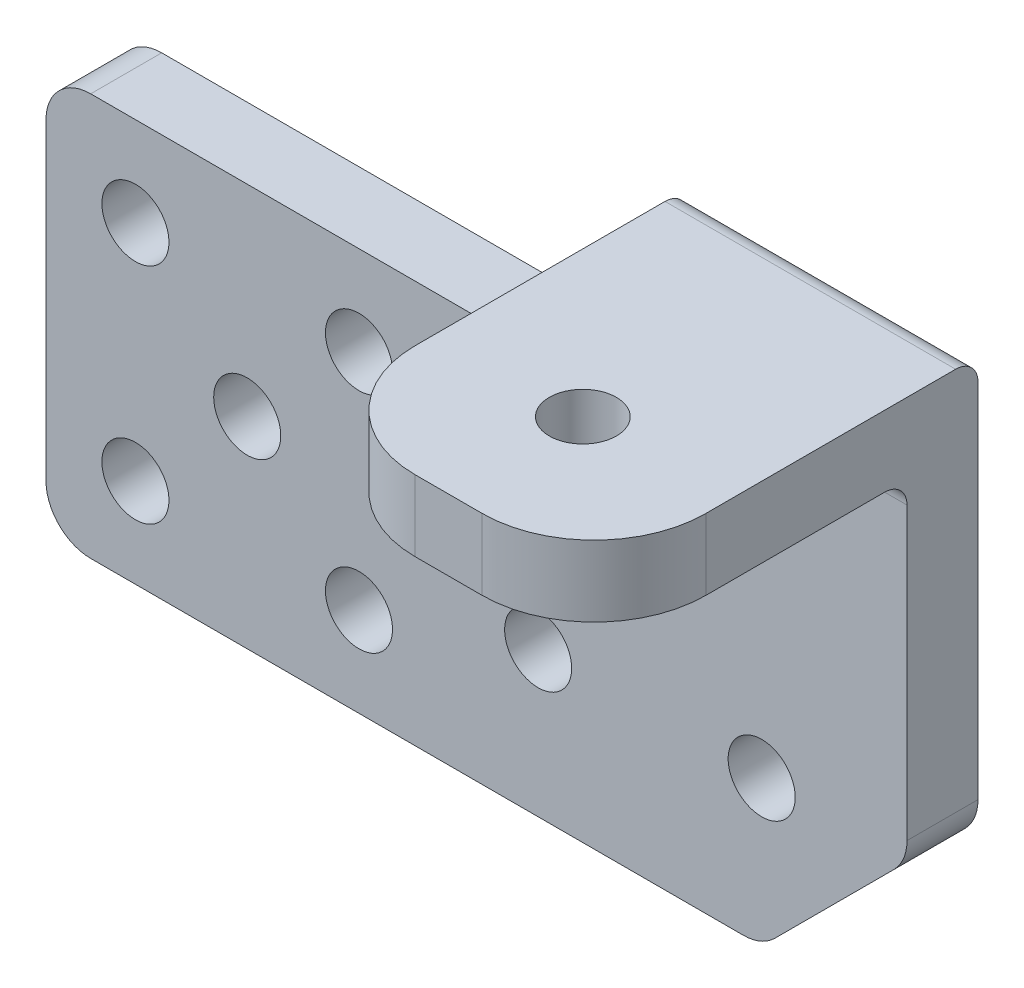
ISO-10303-21;
HEADER;
FILE_DESCRIPTION(('STEP AP214'),'2;1');
FILE_NAME('part.step','',(''),(''),'','','');
FILE_SCHEMA(('AUTOMOTIVE_DESIGN { 1 0 10303 214 1 1 1 1 }'));
ENDSEC;
DATA;
#1=APPLICATION_CONTEXT('core data for automotive mechanical design processes');
#2=APPLICATION_PROTOCOL_DEFINITION('international standard','automotive_design',2000,#1);
#3=PRODUCT_CONTEXT('',#1,'mechanical');
#4=PRODUCT('Part','Part','',(#3));
#5=PRODUCT_RELATED_PRODUCT_CATEGORY('part','',(#4));
#6=PRODUCT_DEFINITION_FORMATION('','',#4);
#7=PRODUCT_DEFINITION_CONTEXT('part definition',#1,'design');
#8=PRODUCT_DEFINITION('design','',#6,#7);
#9=PRODUCT_DEFINITION_SHAPE('','',#8);
#10=(LENGTH_UNIT() NAMED_UNIT(*) SI_UNIT(.MILLI.,.METRE.));
#11=(NAMED_UNIT(*) PLANE_ANGLE_UNIT() SI_UNIT($,.RADIAN.));
#12=(NAMED_UNIT(*) SI_UNIT($,.STERADIAN.) SOLID_ANGLE_UNIT());
#13=UNCERTAINTY_MEASURE_WITH_UNIT(LENGTH_MEASURE(1.E-05),#10,'distance_accuracy_value','');
#14=(GEOMETRIC_REPRESENTATION_CONTEXT(3) GLOBAL_UNCERTAINTY_ASSIGNED_CONTEXT((#13)) GLOBAL_UNIT_ASSIGNED_CONTEXT((#10,
#11,#12)) REPRESENTATION_CONTEXT('',''));
#15=CARTESIAN_POINT('',(0.,0.,0.));
#16=DIRECTION('',(0.,0.,1.));
#17=DIRECTION('',(1.,0.,0.));
#18=AXIS2_PLACEMENT_3D('',#15,#16,#17);
#19=CARTESIAN_POINT('',(6.5,0.,3.175));
#20=DIRECTION('',(1.,0.,0.));
#21=DIRECTION('',(0.,0.,-1.));
#22=AXIS2_PLACEMENT_3D('',#19,#20,#21);
#23=PLANE('',#22);
#24=DIRECTION('',(0.,-1.,0.));
#25=VECTOR('',#24,1.);
#26=CARTESIAN_POINT('',(6.5,0.,3.175));
#27=LINE('',#26,#25);
#28=CARTESIAN_POINT('',(6.5,13.825,3.175));
#29=VERTEX_POINT('',#28);
#30=CARTESIAN_POINT('',(6.5,0.82842712474619,3.175));
#31=VERTEX_POINT('',#30);
#32=EDGE_CURVE('E233',#29,#31,#27,.T.);
#33=ORIENTED_EDGE('',*,*,#32,.T.);
#34=DIRECTION('',(0.,0.,-1.));
#35=VECTOR('',#34,1.);
#36=CARTESIAN_POINT('',(6.5,0.82842712474619,0.));
#37=LINE('',#36,#35);
#38=CARTESIAN_POINT('',(6.5,0.82842712474619,0.));
#39=VERTEX_POINT('',#38);
#40=EDGE_CURVE('E369',#31,#39,#37,.T.);
#41=ORIENTED_EDGE('',*,*,#40,.T.);
#42=DIRECTION('',(0.,-1.,0.));
#43=VECTOR('',#42,1.);
#44=CARTESIAN_POINT('',(6.5,0.,0.));
#45=LINE('',#44,#43);
#46=CARTESIAN_POINT('',(6.5,17.,0.));
#47=VERTEX_POINT('',#46);
#48=EDGE_CURVE('E241',#47,#39,#45,.T.);
#49=ORIENTED_EDGE('',*,*,#48,.F.);
#50=CARTESIAN_POINT('',(6.5,17.,1.));
#51=DIRECTION('',(1.,0.,0.));
#52=DIRECTION('',(0.,0.,-1.));
#53=AXIS2_PLACEMENT_3D('',#50,#51,#52);
#54=CIRCLE('',#53,1.);
#55=CARTESIAN_POINT('',(6.5,18.,1.));
#56=VERTEX_POINT('',#55);
#57=EDGE_CURVE('E273',#47,#56,#54,.T.);
#58=ORIENTED_EDGE('',*,*,#57,.T.);
#59=DIRECTION('',(0.,0.,-1.));
#60=VECTOR('',#59,1.);
#61=CARTESIAN_POINT('',(6.5,18.,3.175));
#62=LINE('',#61,#60);
#63=CARTESIAN_POINT('',(6.5,18.,12.175));
#64=VERTEX_POINT('',#63);
#65=EDGE_CURVE('E250',#64,#56,#62,.T.);
#66=ORIENTED_EDGE('',*,*,#65,.F.);
#67=DIRECTION('',(0.,1.,0.));
#68=VECTOR('',#67,1.);
#69=CARTESIAN_POINT('',(6.5,0.,12.175));
#70=LINE('',#69,#68);
#71=CARTESIAN_POINT('',(6.5,14.825,12.175));
#72=VERTEX_POINT('',#71);
#73=EDGE_CURVE('E266',#64,#72,#70,.F.);
#74=ORIENTED_EDGE('',*,*,#73,.T.);
#75=DIRECTION('',(0.,0.,-1.));
#76=VECTOR('',#75,1.);
#77=CARTESIAN_POINT('',(6.5,14.825,17.175));
#78=LINE('',#77,#76);
#79=CARTESIAN_POINT('',(6.5,14.825,4.175));
#80=VERTEX_POINT('',#79);
#81=EDGE_CURVE('E214',#72,#80,#78,.T.);
#82=ORIENTED_EDGE('',*,*,#81,.T.);
#83=CARTESIAN_POINT('',(6.5,13.825,4.175));
#84=DIRECTION('',(1.,0.,0.));
#85=DIRECTION('',(0.,0.,-1.));
#86=AXIS2_PLACEMENT_3D('',#83,#84,#85);
#87=CIRCLE('',#86,1.);
#88=EDGE_CURVE('E291',#80,#29,#87,.F.);
#89=ORIENTED_EDGE('',*,*,#88,.T.);
#90=EDGE_LOOP('',(#33,#41,#49,#58,#66,#74,#82,#89));
#91=FACE_BOUND('',#90,.T.);
#92=ADVANCED_FACE('F41',(#91),#23,.T.);
#93=CARTESIAN_POINT('',(0.,18.,3.175));
#94=DIRECTION('',(0.,1.,0.));
#95=DIRECTION('',(0.,0.,1.));
#96=AXIS2_PLACEMENT_3D('',#93,#94,#95);
#97=PLANE('',#96);
#98=CARTESIAN_POINT('',(0.,18.,11.175));
#99=DIRECTION('',(0.,1.,0.));
#100=DIRECTION('',(0.,0.,1.));
#101=AXIS2_PLACEMENT_3D('',#98,#99,#100);
#102=CIRCLE('',#101,1.5);
#103=CARTESIAN_POINT('',(0.,18.,12.675));
#104=VERTEX_POINT('',#103);
#105=EDGE_CURVE('E217',#104,#104,#102,.T.);
#106=ORIENTED_EDGE('',*,*,#105,.F.);
#107=EDGE_LOOP('',(#106));
#108=FACE_BOUND('',#107,.T.);
#109=ORIENTED_EDGE('',*,*,#65,.T.);
#110=DIRECTION('',(1.,0.,0.));
#111=VECTOR('',#110,1.);
#112=CARTESIAN_POINT('',(-6.5,18.,1.));
#113=LINE('',#112,#111);
#114=CARTESIAN_POINT('',(-6.5,18.,1.));
#115=VERTEX_POINT('',#114);
#116=EDGE_CURVE('E276',#56,#115,#113,.F.);
#117=ORIENTED_EDGE('',*,*,#116,.T.);
#118=DIRECTION('',(0.,0.,-1.));
#119=VECTOR('',#118,1.);
#120=CARTESIAN_POINT('',(-6.5,18.,3.175));
#121=LINE('',#120,#119);
#122=CARTESIAN_POINT('',(-6.5,18.,12.175));
#123=VERTEX_POINT('',#122);
#124=EDGE_CURVE('E237',#123,#115,#121,.T.);
#125=ORIENTED_EDGE('',*,*,#124,.F.);
#126=CARTESIAN_POINT('',(-1.5,18.,12.175));
#127=DIRECTION('',(0.,1.,0.));
#128=DIRECTION('',(0.,0.,1.));
#129=AXIS2_PLACEMENT_3D('',#126,#127,#128);
#130=CIRCLE('',#129,5.);
#131=CARTESIAN_POINT('',(-1.5,18.,17.175));
#132=VERTEX_POINT('',#131);
#133=EDGE_CURVE('E263',#123,#132,#130,.T.);
#134=ORIENTED_EDGE('',*,*,#133,.T.);
#135=DIRECTION('',(-1.,0.,0.));
#136=VECTOR('',#135,1.);
#137=CARTESIAN_POINT('',(-6.5,18.,17.175));
#138=LINE('',#137,#136);
#139=CARTESIAN_POINT('',(1.5,18.,17.175));
#140=VERTEX_POINT('',#139);
#141=EDGE_CURVE('E202',#140,#132,#138,.T.);
#142=ORIENTED_EDGE('',*,*,#141,.F.);
#143=CARTESIAN_POINT('',(1.5,18.,12.175));
#144=DIRECTION('',(0.,1.,0.));
#145=DIRECTION('',(0.,0.,1.));
#146=AXIS2_PLACEMENT_3D('',#143,#144,#145);
#147=CIRCLE('',#146,5.);
#148=EDGE_CURVE('E260',#140,#64,#147,.T.);
#149=ORIENTED_EDGE('',*,*,#148,.T.);
#150=EDGE_LOOP('',(#109,#117,#125,#134,#142,#149));
#151=FACE_BOUND('',#150,.T.);
#152=ADVANCED_FACE('F527',(#108,#151),#97,.T.);
#153=CARTESIAN_POINT('',(0.,0.,3.175));
#154=DIRECTION('',(0.,0.,-1.));
#155=DIRECTION('',(-1.,0.,0.));
#156=AXIS2_PLACEMENT_3D('',#153,#154,#155);
#157=CYLINDRICAL_SURFACE('',#156,1.5);
#158=CARTESIAN_POINT('',(0.,0.,3.175));
#159=DIRECTION('',(0.,0.,1.));
#160=DIRECTION('',(1.,0.,0.));
#161=AXIS2_PLACEMENT_3D('',#158,#159,#160);
#162=CIRCLE('',#161,1.5);
#163=CARTESIAN_POINT('',(1.5,0.,3.175));
#164=VERTEX_POINT('',#163);
#165=EDGE_CURVE('E229',#164,#164,#162,.T.);
#166=ORIENTED_EDGE('',*,*,#165,.T.);
#167=EDGE_LOOP('',(#166));
#168=FACE_BOUND('',#167,.T.);
#169=CARTESIAN_POINT('',(0.,0.,0.));
#170=DIRECTION('',(0.,0.,1.));
#171=DIRECTION('',(1.,0.,0.));
#172=AXIS2_PLACEMENT_3D('',#169,#170,#171);
#173=CIRCLE('',#172,1.5);
#174=CARTESIAN_POINT('',(1.5,0.,0.));
#175=VERTEX_POINT('',#174);
#176=EDGE_CURVE('E228',#175,#175,#173,.T.);
#177=ORIENTED_EDGE('',*,*,#176,.F.);
#178=EDGE_LOOP('',(#177));
#179=FACE_BOUND('',#178,.T.);
#180=ADVANCED_FACE('F532',(#168,#179),#157,.F.);
#181=CARTESIAN_POINT('',(-6.5,0.,3.175));
#182=DIRECTION('',(-1.,0.,0.));
#183=DIRECTION('',(0.,0.,1.));
#184=AXIS2_PLACEMENT_3D('',#181,#182,#183);
#185=PLANE('',#184);
#186=DIRECTION('',(0.,1.,0.));
#187=VECTOR('',#186,1.);
#188=CARTESIAN_POINT('',(-6.5,0.,0.));
#189=LINE('',#188,#187);
#190=CARTESIAN_POINT('',(-6.5,16.3284271247462,0.));
#191=VERTEX_POINT('',#190);
#192=CARTESIAN_POINT('',(-6.5,17.,0.));
#193=VERTEX_POINT('',#192);
#194=EDGE_CURVE('E234',#191,#193,#189,.T.);
#195=ORIENTED_EDGE('',*,*,#194,.F.);
#196=DIRECTION('',(0.,0.,-1.));
#197=VECTOR('',#196,1.);
#198=CARTESIAN_POINT('',(-6.5,16.3284271247462,3.175));
#199=LINE('',#198,#197);
#200=CARTESIAN_POINT('',(-6.5,16.3284271247462,3.175));
#201=VERTEX_POINT('',#200);
#202=EDGE_CURVE('E345',#191,#201,#199,.F.);
#203=ORIENTED_EDGE('',*,*,#202,.T.);
#204=DIRECTION('',(0.,-1.,0.));
#205=VECTOR('',#204,1.);
#206=CARTESIAN_POINT('',(-6.5,0.,3.175));
#207=LINE('',#206,#205);
#208=CARTESIAN_POINT('',(-6.5,13.825,3.175));
#209=VERTEX_POINT('',#208);
#210=EDGE_CURVE('E297',#201,#209,#207,.T.);
#211=ORIENTED_EDGE('',*,*,#210,.T.);
#212=CARTESIAN_POINT('',(-6.5,13.825,4.175));
#213=DIRECTION('',(-1.,0.,0.));
#214=DIRECTION('',(0.,0.,1.));
#215=AXIS2_PLACEMENT_3D('',#212,#213,#214);
#216=CIRCLE('',#215,1.);
#217=CARTESIAN_POINT('',(-6.5,14.825,4.175));
#218=VERTEX_POINT('',#217);
#219=EDGE_CURVE('E294',#209,#218,#216,.F.);
#220=ORIENTED_EDGE('',*,*,#219,.T.);
#221=DIRECTION('',(0.,0.,-1.));
#222=VECTOR('',#221,1.);
#223=CARTESIAN_POINT('',(-6.5,14.825,17.175));
#224=LINE('',#223,#222);
#225=CARTESIAN_POINT('',(-6.5,14.825,12.175));
#226=VERTEX_POINT('',#225);
#227=EDGE_CURVE('E225',#226,#218,#224,.T.);
#228=ORIENTED_EDGE('',*,*,#227,.F.);
#229=DIRECTION('',(0.,-1.,0.));
#230=VECTOR('',#229,1.);
#231=CARTESIAN_POINT('',(-6.5,0.,12.175));
#232=LINE('',#231,#230);
#233=EDGE_CURVE('E186',#226,#123,#232,.F.);
#234=ORIENTED_EDGE('',*,*,#233,.T.);
#235=ORIENTED_EDGE('',*,*,#124,.T.);
#236=CARTESIAN_POINT('',(-6.5,17.,1.));
#237=DIRECTION('',(-1.,0.,0.));
#238=DIRECTION('',(0.,0.,1.));
#239=AXIS2_PLACEMENT_3D('',#236,#237,#238);
#240=CIRCLE('',#239,1.);
#241=EDGE_CURVE('E279',#115,#193,#240,.T.);
#242=ORIENTED_EDGE('',*,*,#241,.T.);
#243=EDGE_LOOP('',(#195,#203,#211,#220,#228,#234,#235,#242));
#244=FACE_BOUND('',#243,.T.);
#245=ADVANCED_FACE('F399',(#244),#185,.T.);
#246=CARTESIAN_POINT('',(0.,0.,3.175));
#247=DIRECTION('',(0.,0.,1.));
#248=DIRECTION('',(1.,0.,0.));
#249=AXIS2_PLACEMENT_3D('',#246,#247,#248);
#250=PLANE('',#249);
#251=DIRECTION('',(-1.,0.,0.));
#252=VECTOR('',#251,1.);
#253=CARTESIAN_POINT('',(0.,-6.5,3.175));
#254=LINE('',#253,#252);
#255=CARTESIAN_POINT('',(-0.82842712474619,-6.5,3.175));
#256=VERTEX_POINT('',#255);
#257=CARTESIAN_POINT('',(-30.0129229130922,-6.5,3.175));
#258=VERTEX_POINT('',#257);
#259=EDGE_CURVE('E474',#256,#258,#254,.T.);
#260=ORIENTED_EDGE('',*,*,#259,.F.);
#261=CARTESIAN_POINT('',(-0.82842712474619,-4.5,3.175));
#262=DIRECTION('',(0.,0.,1.));
#263=DIRECTION('',(1.,0.,0.));
#264=AXIS2_PLACEMENT_3D('',#261,#262,#263);
#265=CIRCLE('',#264,2.);
#266=CARTESIAN_POINT('',(0.585786437626904,-5.9142135623731,3.175));
#267=VERTEX_POINT('',#266);
#268=EDGE_CURVE('E366',#256,#267,#265,.T.);
#269=ORIENTED_EDGE('',*,*,#268,.T.);
#270=DIRECTION('',(-0.707106781186548,-0.707106781186548,0.));
#271=VECTOR('',#270,1.);
#272=CARTESIAN_POINT('',(3.25,-3.25,3.175));
#273=LINE('',#272,#271);
#274=CARTESIAN_POINT('',(5.9142135623731,-0.585786437626904,3.175));
#275=VERTEX_POINT('',#274);
#276=EDGE_CURVE('E419',#275,#267,#273,.T.);
#277=ORIENTED_EDGE('',*,*,#276,.F.);
#278=CARTESIAN_POINT('',(4.5,0.82842712474619,3.175));
#279=DIRECTION('',(0.,0.,1.));
#280=DIRECTION('',(1.,0.,0.));
#281=AXIS2_PLACEMENT_3D('',#278,#279,#280);
#282=CIRCLE('',#281,2.);
#283=EDGE_CURVE('E57',#275,#31,#282,.T.);
#284=ORIENTED_EDGE('',*,*,#283,.T.);
#285=ORIENTED_EDGE('',*,*,#32,.F.);
#286=DIRECTION('',(1.,0.,0.));
#287=VECTOR('',#286,1.);
#288=CARTESIAN_POINT('',(0.,13.825,3.175));
#289=LINE('',#288,#287);
#290=EDGE_CURVE('E287',#29,#209,#289,.F.);
#291=ORIENTED_EDGE('',*,*,#290,.T.);
#292=ORIENTED_EDGE('',*,*,#210,.F.);
#293=CARTESIAN_POINT('',(-8.5,16.3284271247462,3.175));
#294=DIRECTION('',(0.,0.,1.));
#295=DIRECTION('',(1.,0.,0.));
#296=AXIS2_PLACEMENT_3D('',#293,#294,#295);
#297=CIRCLE('',#296,2.);
#298=CARTESIAN_POINT('',(-7.08578643762691,14.9142135623731,3.175));
#299=VERTEX_POINT('',#298);
#300=EDGE_CURVE('E50',#201,#299,#297,.F.);
#301=ORIENTED_EDGE('',*,*,#300,.T.);
#302=DIRECTION('',(0.707106781186551,0.707106781186544,0.));
#303=VECTOR('',#302,1.);
#304=CARTESIAN_POINT('',(-10.5,11.5,3.175));
#305=LINE('',#304,#303);
#306=CARTESIAN_POINT('',(-9.91421356237311,12.0857864376269,3.175));
#307=VERTEX_POINT('',#306);
#308=EDGE_CURVE('E304',#299,#307,#305,.F.);
#309=ORIENTED_EDGE('',*,*,#308,.T.);
#310=CARTESIAN_POINT('',(-11.3284271247462,13.5,3.175));
#311=DIRECTION('',(0.,0.,1.));
#312=DIRECTION('',(1.,0.,0.));
#313=AXIS2_PLACEMENT_3D('',#310,#311,#312);
#314=CIRCLE('',#313,2.);
#315=CARTESIAN_POINT('',(-11.3284271247462,11.5,3.175));
#316=VERTEX_POINT('',#315);
#317=EDGE_CURVE('E376',#307,#316,#314,.F.);
#318=ORIENTED_EDGE('',*,*,#317,.T.);
#319=DIRECTION('',(1.,0.,0.));
#320=VECTOR('',#319,1.);
#321=CARTESIAN_POINT('',(0.,11.5,3.175));
#322=LINE('',#321,#320);
#323=CARTESIAN_POINT('',(-30.0129229130922,11.5,3.175));
#324=VERTEX_POINT('',#323);
#325=EDGE_CURVE('E469',#324,#316,#322,.T.);
#326=ORIENTED_EDGE('',*,*,#325,.F.);
#327=CARTESIAN_POINT('',(-30.0129229130922,9.50000000000003,3.175));
#328=DIRECTION('',(0.,0.,1.));
#329=DIRECTION('',(1.,0.,0.));
#330=AXIS2_PLACEMENT_3D('',#327,#328,#329);
#331=CIRCLE('',#330,2.);
#332=CARTESIAN_POINT('',(-32.0129229130922,9.50000000000003,3.175));
#333=VERTEX_POINT('',#332);
#334=EDGE_CURVE('E325',#324,#333,#331,.T.);
#335=ORIENTED_EDGE('',*,*,#334,.T.);
#336=DIRECTION('',(0.,1.,0.));
#337=VECTOR('',#336,1.);
#338=CARTESIAN_POINT('',(-32.0129229130922,0.,3.175));
#339=LINE('',#338,#337);
#340=CARTESIAN_POINT('',(-32.0129229130922,-4.5,3.175));
#341=VERTEX_POINT('',#340);
#342=EDGE_CURVE('E465',#341,#333,#339,.T.);
#343=ORIENTED_EDGE('',*,*,#342,.F.);
#344=CARTESIAN_POINT('',(-30.0129229130922,-4.5,3.175));
#345=DIRECTION('',(0.,0.,1.));
#346=DIRECTION('',(1.,0.,0.));
#347=AXIS2_PLACEMENT_3D('',#344,#345,#346);
#348=CIRCLE('',#347,2.);
#349=EDGE_CURVE('E328',#341,#258,#348,.T.);
#350=ORIENTED_EDGE('',*,*,#349,.T.);
#351=EDGE_LOOP('',(#260,#269,#277,#284,#285,#291,#292,#301,#309,#318,#326,#335,#343,#350));
#352=FACE_BOUND('',#351,.T.);
#353=CARTESIAN_POINT('',(-28.0129229130922,7.50000000000006,3.175));
#354=DIRECTION('',(0.,0.,-1.));
#355=DIRECTION('',(-1.,0.,0.));
#356=AXIS2_PLACEMENT_3D('',#353,#354,#355);
#357=CIRCLE('',#356,1.50000000000011);
#358=CARTESIAN_POINT('',(-29.5129229130923,7.50000000000006,3.175));
#359=VERTEX_POINT('',#358);
#360=EDGE_CURVE('E450',#359,#359,#357,.T.);
#361=ORIENTED_EDGE('',*,*,#360,.T.);
#362=EDGE_LOOP('',(#361));
#363=FACE_BOUND('',#362,.T.);
#364=CARTESIAN_POINT('',(-28.0129229130922,-2.49999999999994,3.175));
#365=DIRECTION('',(0.,0.,-1.));
#366=DIRECTION('',(-1.,0.,0.));
#367=AXIS2_PLACEMENT_3D('',#364,#365,#366);
#368=CIRCLE('',#367,1.50000000000011);
#369=CARTESIAN_POINT('',(-29.5129229130923,-2.49999999999994,3.175));
#370=VERTEX_POINT('',#369);
#371=EDGE_CURVE('E442',#370,#370,#368,.T.);
#372=ORIENTED_EDGE('',*,*,#371,.T.);
#373=EDGE_LOOP('',(#372));
#374=FACE_BOUND('',#373,.T.);
#375=CARTESIAN_POINT('',(-18.0129229130922,-2.49999999999994,3.175));
#376=DIRECTION('',(0.,0.,-1.));
#377=DIRECTION('',(-1.,0.,0.));
#378=AXIS2_PLACEMENT_3D('',#375,#376,#377);
#379=CIRCLE('',#378,1.5000000000001);
#380=CARTESIAN_POINT('',(-19.5129229130923,-2.49999999999994,3.175));
#381=VERTEX_POINT('',#380);
#382=EDGE_CURVE('E434',#381,#381,#379,.T.);
#383=ORIENTED_EDGE('',*,*,#382,.T.);
#384=EDGE_LOOP('',(#383));
#385=FACE_BOUND('',#384,.T.);
#386=CARTESIAN_POINT('',(-23.0129229130923,2.50000000000004,3.175));
#387=DIRECTION('',(0.,0.,-1.));
#388=DIRECTION('',(-1.,0.,0.));
#389=AXIS2_PLACEMENT_3D('',#386,#387,#388);
#390=CIRCLE('',#389,1.5);
#391=CARTESIAN_POINT('',(-24.5129229130923,2.50000000000004,3.175));
#392=VERTEX_POINT('',#391);
#393=EDGE_CURVE('E425',#392,#392,#390,.T.);
#394=ORIENTED_EDGE('',*,*,#393,.T.);
#395=EDGE_LOOP('',(#394));
#396=FACE_BOUND('',#395,.T.);
#397=CARTESIAN_POINT('',(-18.0129229130922,7.50000000000006,3.175));
#398=DIRECTION('',(0.,0.,-1.));
#399=DIRECTION('',(-1.,0.,0.));
#400=AXIS2_PLACEMENT_3D('',#397,#398,#399);
#401=CIRCLE('',#400,1.50000000000011);
#402=CARTESIAN_POINT('',(-19.5129229130923,7.50000000000006,3.175));
#403=VERTEX_POINT('',#402);
#404=EDGE_CURVE('E457',#403,#403,#401,.T.);
#405=ORIENTED_EDGE('',*,*,#404,.T.);
#406=EDGE_LOOP('',(#405));
#407=FACE_BOUND('',#406,.T.);
#408=ORIENTED_EDGE('',*,*,#165,.F.);
#409=EDGE_LOOP('',(#408));
#410=FACE_BOUND('',#409,.T.);
#411=CARTESIAN_POINT('',(-10.,0.,3.175));
#412=DIRECTION('',(0.,0.,1.));
#413=DIRECTION('',(1.,0.,0.));
#414=AXIS2_PLACEMENT_3D('',#411,#412,#413);
#415=CIRCLE('',#414,1.5);
#416=CARTESIAN_POINT('',(-8.5,0.,3.175));
#417=VERTEX_POINT('',#416);
#418=EDGE_CURVE('E488',#417,#417,#415,.F.);
#419=ORIENTED_EDGE('',*,*,#418,.T.);
#420=EDGE_LOOP('',(#419));
#421=FACE_BOUND('',#420,.T.);
#422=ADVANCED_FACE('F381',(#352,#363,#374,#385,#396,#407,#410,#421),#250,.T.);
#423=CARTESIAN_POINT('',(0.,0.,0.));
#424=DIRECTION('',(0.,0.,1.));
#425=DIRECTION('',(1.,0.,0.));
#426=AXIS2_PLACEMENT_3D('',#423,#424,#425);
#427=PLANE('',#426);
#428=CARTESIAN_POINT('',(-28.0129229130922,7.50000000000006,0.));
#429=DIRECTION('',(0.,0.,-1.));
#430=DIRECTION('',(-1.,0.,0.));
#431=AXIS2_PLACEMENT_3D('',#428,#429,#430);
#432=CIRCLE('',#431,1.50000000000011);
#433=CARTESIAN_POINT('',(-29.5129229130923,7.50000000000006,0.));
#434=VERTEX_POINT('',#433);
#435=EDGE_CURVE('E422',#434,#434,#432,.T.);
#436=ORIENTED_EDGE('',*,*,#435,.F.);
#437=EDGE_LOOP('',(#436));
#438=FACE_BOUND('',#437,.T.);
#439=CARTESIAN_POINT('',(-28.0129229130922,-2.49999999999994,0.));
#440=DIRECTION('',(0.,0.,-1.));
#441=DIRECTION('',(-1.,0.,0.));
#442=AXIS2_PLACEMENT_3D('',#439,#440,#441);
#443=CIRCLE('',#442,1.50000000000011);
#444=CARTESIAN_POINT('',(-29.5129229130923,-2.49999999999994,0.));
#445=VERTEX_POINT('',#444);
#446=EDGE_CURVE('E446',#445,#445,#443,.T.);
#447=ORIENTED_EDGE('',*,*,#446,.F.);
#448=EDGE_LOOP('',(#447));
#449=FACE_BOUND('',#448,.T.);
#450=CARTESIAN_POINT('',(-18.0129229130922,-2.49999999999994,0.));
#451=DIRECTION('',(0.,0.,-1.));
#452=DIRECTION('',(-1.,0.,0.));
#453=AXIS2_PLACEMENT_3D('',#450,#451,#452);
#454=CIRCLE('',#453,1.5000000000001);
#455=CARTESIAN_POINT('',(-19.5129229130923,-2.49999999999994,0.));
#456=VERTEX_POINT('',#455);
#457=EDGE_CURVE('E438',#456,#456,#454,.T.);
#458=ORIENTED_EDGE('',*,*,#457,.F.);
#459=EDGE_LOOP('',(#458));
#460=FACE_BOUND('',#459,.T.);
#461=CARTESIAN_POINT('',(-23.0129229130923,2.50000000000004,0.));
#462=DIRECTION('',(0.,0.,-1.));
#463=DIRECTION('',(-1.,0.,0.));
#464=AXIS2_PLACEMENT_3D('',#461,#462,#463);
#465=CIRCLE('',#464,1.5);
#466=CARTESIAN_POINT('',(-24.5129229130923,2.50000000000004,0.));
#467=VERTEX_POINT('',#466);
#468=EDGE_CURVE('E430',#467,#467,#465,.T.);
#469=ORIENTED_EDGE('',*,*,#468,.F.);
#470=EDGE_LOOP('',(#469));
#471=FACE_BOUND('',#470,.T.);
#472=CARTESIAN_POINT('',(-18.0129229130922,7.50000000000006,0.));
#473=DIRECTION('',(0.,0.,-1.));
#474=DIRECTION('',(-1.,0.,0.));
#475=AXIS2_PLACEMENT_3D('',#472,#473,#474);
#476=CIRCLE('',#475,1.50000000000011);
#477=CARTESIAN_POINT('',(-19.5129229130923,7.50000000000006,0.));
#478=VERTEX_POINT('',#477);
#479=EDGE_CURVE('E429',#478,#478,#476,.T.);
#480=ORIENTED_EDGE('',*,*,#479,.F.);
#481=EDGE_LOOP('',(#480));
#482=FACE_BOUND('',#481,.T.);
#483=DIRECTION('',(0.707106781186548,0.707106781186548,0.));
#484=VECTOR('',#483,1.);
#485=CARTESIAN_POINT('',(6.5,0.,0.));
#486=LINE('',#485,#484);
#487=CARTESIAN_POINT('',(0.585786437626904,-5.9142135623731,0.));
#488=VERTEX_POINT('',#487);
#489=CARTESIAN_POINT('',(5.9142135623731,-0.585786437626905,0.));
#490=VERTEX_POINT('',#489);
#491=EDGE_CURVE('E413',#488,#490,#486,.T.);
#492=ORIENTED_EDGE('',*,*,#491,.F.);
#493=CARTESIAN_POINT('',(-0.82842712474619,-4.5,0.));
#494=DIRECTION('',(0.,0.,1.));
#495=DIRECTION('',(1.,0.,0.));
#496=AXIS2_PLACEMENT_3D('',#493,#494,#495);
#497=CIRCLE('',#496,2.);
#498=CARTESIAN_POINT('',(-0.82842712474619,-6.5,0.));
#499=VERTEX_POINT('',#498);
#500=EDGE_CURVE('E359',#488,#499,#497,.F.);
#501=ORIENTED_EDGE('',*,*,#500,.T.);
#502=DIRECTION('',(-1.,0.,0.));
#503=VECTOR('',#502,1.);
#504=CARTESIAN_POINT('',(0.,-6.5,0.));
#505=LINE('',#504,#503);
#506=CARTESIAN_POINT('',(-30.0129229130922,-6.5,0.));
#507=VERTEX_POINT('',#506);
#508=EDGE_CURVE('E485',#499,#507,#505,.T.);
#509=ORIENTED_EDGE('',*,*,#508,.T.);
#510=CARTESIAN_POINT('',(-30.0129229130922,-4.5,0.));
#511=DIRECTION('',(0.,0.,1.));
#512=DIRECTION('',(1.,0.,0.));
#513=AXIS2_PLACEMENT_3D('',#510,#511,#512);
#514=CIRCLE('',#513,2.);
#515=CARTESIAN_POINT('',(-32.0129229130922,-4.5,0.));
#516=VERTEX_POINT('',#515);
#517=EDGE_CURVE('E315',#507,#516,#514,.F.);
#518=ORIENTED_EDGE('',*,*,#517,.T.);
#519=DIRECTION('',(0.,1.,0.));
#520=VECTOR('',#519,1.);
#521=CARTESIAN_POINT('',(-32.0129229130922,0.,0.));
#522=LINE('',#521,#520);
#523=CARTESIAN_POINT('',(-32.0129229130922,9.50000000000003,0.));
#524=VERTEX_POINT('',#523);
#525=EDGE_CURVE('E461',#516,#524,#522,.T.);
#526=ORIENTED_EDGE('',*,*,#525,.T.);
#527=CARTESIAN_POINT('',(-30.0129229130922,9.50000000000003,0.));
#528=DIRECTION('',(0.,0.,1.));
#529=DIRECTION('',(1.,0.,0.));
#530=AXIS2_PLACEMENT_3D('',#527,#528,#529);
#531=CIRCLE('',#530,2.);
#532=CARTESIAN_POINT('',(-30.0129229130922,11.5,0.));
#533=VERTEX_POINT('',#532);
#534=EDGE_CURVE('E312',#524,#533,#531,.F.);
#535=ORIENTED_EDGE('',*,*,#534,.T.);
#536=DIRECTION('',(1.,0.,0.));
#537=VECTOR('',#536,1.);
#538=CARTESIAN_POINT('',(0.,11.5,0.));
#539=LINE('',#538,#537);
#540=CARTESIAN_POINT('',(-11.3284271247462,11.5,0.));
#541=VERTEX_POINT('',#540);
#542=EDGE_CURVE('E470',#533,#541,#539,.T.);
#543=ORIENTED_EDGE('',*,*,#542,.T.);
#544=CARTESIAN_POINT('',(-11.3284271247462,13.5,0.));
#545=DIRECTION('',(0.,0.,1.));
#546=DIRECTION('',(1.,0.,0.));
#547=AXIS2_PLACEMENT_3D('',#544,#545,#546);
#548=CIRCLE('',#547,2.);
#549=CARTESIAN_POINT('',(-9.91421356237312,12.0857864376269,0.));
#550=VERTEX_POINT('',#549);
#551=EDGE_CURVE('E373',#541,#550,#548,.T.);
#552=ORIENTED_EDGE('',*,*,#551,.T.);
#553=DIRECTION('',(-0.707106781186551,-0.707106781186544,0.));
#554=VECTOR('',#553,1.);
#555=CARTESIAN_POINT('',(-11.,11.0000000000001,0.));
#556=LINE('',#555,#554);
#557=CARTESIAN_POINT('',(-7.08578643762691,14.9142135623731,0.));
#558=VERTEX_POINT('',#557);
#559=EDGE_CURVE('E300',#550,#558,#556,.F.);
#560=ORIENTED_EDGE('',*,*,#559,.T.);
#561=CARTESIAN_POINT('',(-8.5,16.3284271247462,0.));
#562=DIRECTION('',(0.,0.,1.));
#563=DIRECTION('',(1.,0.,0.));
#564=AXIS2_PLACEMENT_3D('',#561,#562,#563);
#565=CIRCLE('',#564,2.);
#566=EDGE_CURVE('E11',#558,#191,#565,.T.);
#567=ORIENTED_EDGE('',*,*,#566,.T.);
#568=ORIENTED_EDGE('',*,*,#194,.T.);
#569=DIRECTION('',(1.,0.,0.));
#570=VECTOR('',#569,1.);
#571=CARTESIAN_POINT('',(6.5,17.,0.));
#572=LINE('',#571,#570);
#573=EDGE_CURVE('E269',#193,#47,#572,.T.);
#574=ORIENTED_EDGE('',*,*,#573,.T.);
#575=ORIENTED_EDGE('',*,*,#48,.T.);
#576=CARTESIAN_POINT('',(4.5,0.82842712474619,0.));
#577=DIRECTION('',(0.,0.,1.));
#578=DIRECTION('',(1.,0.,0.));
#579=AXIS2_PLACEMENT_3D('',#576,#577,#578);
#580=CIRCLE('',#579,2.);
#581=EDGE_CURVE('E356',#39,#490,#580,.F.);
#582=ORIENTED_EDGE('',*,*,#581,.T.);
#583=EDGE_LOOP('',(#492,#501,#509,#518,#526,#535,#543,#552,#560,#567,#568,#574,#575,#582));
#584=FACE_BOUND('',#583,.T.);
#585=CARTESIAN_POINT('',(-10.,0.,0.));
#586=DIRECTION('',(0.,0.,-1.));
#587=DIRECTION('',(-1.,0.,0.));
#588=AXIS2_PLACEMENT_3D('',#585,#586,#587);
#589=CIRCLE('',#588,1.5);
#590=CARTESIAN_POINT('',(-11.5,0.,0.));
#591=VERTEX_POINT('',#590);
#592=EDGE_CURVE('E481',#591,#591,#589,.T.);
#593=ORIENTED_EDGE('',*,*,#592,.F.);
#594=EDGE_LOOP('',(#593));
#595=FACE_BOUND('',#594,.T.);
#596=ORIENTED_EDGE('',*,*,#176,.T.);
#597=EDGE_LOOP('',(#596));
#598=FACE_BOUND('',#597,.T.);
#599=ADVANCED_FACE('F396',(#438,#449,#460,#471,#482,#584,#595,#598),#427,.F.);
#600=CARTESIAN_POINT('',(-6.5,14.825,17.175));
#601=DIRECTION('',(0.,1.,0.));
#602=DIRECTION('',(0.,0.,1.));
#603=AXIS2_PLACEMENT_3D('',#600,#601,#602);
#604=PLANE('',#603);
#605=CARTESIAN_POINT('',(0.,14.825,11.175));
#606=DIRECTION('',(0.,1.,0.));
#607=DIRECTION('',(0.,0.,1.));
#608=AXIS2_PLACEMENT_3D('',#605,#606,#607);
#609=CIRCLE('',#608,1.5);
#610=CARTESIAN_POINT('',(0.,14.825,12.675));
#611=VERTEX_POINT('',#610);
#612=EDGE_CURVE('E210',#611,#611,#609,.T.);
#613=ORIENTED_EDGE('',*,*,#612,.T.);
#614=EDGE_LOOP('',(#613));
#615=FACE_BOUND('',#614,.T.);
#616=ORIENTED_EDGE('',*,*,#227,.T.);
#617=DIRECTION('',(1.,0.,0.));
#618=VECTOR('',#617,1.);
#619=CARTESIAN_POINT('',(-6.5,14.825,4.175));
#620=LINE('',#619,#618);
#621=EDGE_CURVE('E283',#218,#80,#620,.T.);
#622=ORIENTED_EDGE('',*,*,#621,.T.);
#623=ORIENTED_EDGE('',*,*,#81,.F.);
#624=CARTESIAN_POINT('',(1.5,14.825,12.175));
#625=DIRECTION('',(0.,1.,0.));
#626=DIRECTION('',(0.,0.,1.));
#627=AXIS2_PLACEMENT_3D('',#624,#625,#626);
#628=CIRCLE('',#627,5.);
#629=CARTESIAN_POINT('',(1.5,14.825,17.175));
#630=VERTEX_POINT('',#629);
#631=EDGE_CURVE('E192',#72,#630,#628,.F.);
#632=ORIENTED_EDGE('',*,*,#631,.T.);
#633=DIRECTION('',(1.,0.,0.));
#634=VECTOR('',#633,1.);
#635=CARTESIAN_POINT('',(-6.5,14.825,17.175));
#636=LINE('',#635,#634);
#637=CARTESIAN_POINT('',(-1.5,14.825,17.175));
#638=VERTEX_POINT('',#637);
#639=EDGE_CURVE('E199',#638,#630,#636,.T.);
#640=ORIENTED_EDGE('',*,*,#639,.F.);
#641=CARTESIAN_POINT('',(-1.5,14.825,12.175));
#642=DIRECTION('',(0.,1.,0.));
#643=DIRECTION('',(0.,0.,1.));
#644=AXIS2_PLACEMENT_3D('',#641,#642,#643);
#645=CIRCLE('',#644,5.);
#646=EDGE_CURVE('E181',#638,#226,#645,.F.);
#647=ORIENTED_EDGE('',*,*,#646,.T.);
#648=EDGE_LOOP('',(#616,#622,#623,#632,#640,#647));
#649=FACE_BOUND('',#648,.T.);
#650=ADVANCED_FACE('F206',(#615,#649),#604,.F.);
#651=CARTESIAN_POINT('',(0.,0.,17.175));
#652=DIRECTION('',(0.,0.,1.));
#653=DIRECTION('',(1.,0.,0.));
#654=AXIS2_PLACEMENT_3D('',#651,#652,#653);
#655=PLANE('',#654);
#656=ORIENTED_EDGE('',*,*,#141,.T.);
#657=DIRECTION('',(0.,-1.,0.));
#658=VECTOR('',#657,1.);
#659=CARTESIAN_POINT('',(-1.5,0.,17.175));
#660=LINE('',#659,#658);
#661=EDGE_CURVE('E185',#132,#638,#660,.T.);
#662=ORIENTED_EDGE('',*,*,#661,.T.);
#663=ORIENTED_EDGE('',*,*,#639,.T.);
#664=DIRECTION('',(0.,1.,0.));
#665=VECTOR('',#664,1.);
#666=CARTESIAN_POINT('',(1.5,0.,17.175));
#667=LINE('',#666,#665);
#668=EDGE_CURVE('E204',#630,#140,#667,.T.);
#669=ORIENTED_EDGE('',*,*,#668,.T.);
#670=EDGE_LOOP('',(#656,#662,#663,#669));
#671=FACE_BOUND('',#670,.T.);
#672=ADVANCED_FACE('F197',(#671),#655,.T.);
#673=CARTESIAN_POINT('',(0.,0.,11.175));
#674=DIRECTION('',(0.,1.,0.));
#675=DIRECTION('',(0.,0.,1.));
#676=AXIS2_PLACEMENT_3D('',#673,#674,#675);
#677=CYLINDRICAL_SURFACE('',#676,1.5);
#678=ORIENTED_EDGE('',*,*,#105,.T.);
#679=EDGE_LOOP('',(#678));
#680=FACE_BOUND('',#679,.T.);
#681=ORIENTED_EDGE('',*,*,#612,.F.);
#682=EDGE_LOOP('',(#681));
#683=FACE_BOUND('',#682,.T.);
#684=ADVANCED_FACE('F543',(#680,#683),#677,.F.);
#685=CARTESIAN_POINT('',(-1.5,0.,12.175));
#686=DIRECTION('',(0.,-1.,0.));
#687=DIRECTION('',(0.,0.,-1.));
#688=AXIS2_PLACEMENT_3D('',#685,#686,#687);
#689=CYLINDRICAL_SURFACE('',#688,5.);
#690=ORIENTED_EDGE('',*,*,#133,.F.);
#691=ORIENTED_EDGE('',*,*,#233,.F.);
#692=ORIENTED_EDGE('',*,*,#646,.F.);
#693=ORIENTED_EDGE('',*,*,#661,.F.);
#694=EDGE_LOOP('',(#690,#691,#692,#693));
#695=FACE_BOUND('',#694,.T.);
#696=ADVANCED_FACE('F184',(#695),#689,.T.);
#697=CARTESIAN_POINT('',(1.5,0.,12.175));
#698=DIRECTION('',(0.,1.,0.));
#699=DIRECTION('',(0.,0.,1.));
#700=AXIS2_PLACEMENT_3D('',#697,#698,#699);
#701=CYLINDRICAL_SURFACE('',#700,5.);
#702=ORIENTED_EDGE('',*,*,#631,.F.);
#703=ORIENTED_EDGE('',*,*,#73,.F.);
#704=ORIENTED_EDGE('',*,*,#148,.F.);
#705=ORIENTED_EDGE('',*,*,#668,.F.);
#706=EDGE_LOOP('',(#702,#703,#704,#705));
#707=FACE_BOUND('',#706,.T.);
#708=ADVANCED_FACE('F542',(#707),#701,.T.);
#709=CARTESIAN_POINT('',(0.,-6.5,24.1809515376));
#710=DIRECTION('',(0.,-1.,0.));
#711=DIRECTION('',(0.,0.,-1.));
#712=AXIS2_PLACEMENT_3D('',#709,#710,#711);
#713=PLANE('',#712);
#714=ORIENTED_EDGE('',*,*,#508,.F.);
#715=DIRECTION('',(0.,0.,-1.));
#716=VECTOR('',#715,1.);
#717=CARTESIAN_POINT('',(-0.82842712474619,-6.5,3.175));
#718=LINE('',#717,#716);
#719=EDGE_CURVE('E65',#499,#256,#718,.F.);
#720=ORIENTED_EDGE('',*,*,#719,.T.);
#721=ORIENTED_EDGE('',*,*,#259,.T.);
#722=DIRECTION('',(0.,0.,-1.));
#723=VECTOR('',#722,1.);
#724=CARTESIAN_POINT('',(-30.0129229130922,-6.5,24.1809515376));
#725=LINE('',#724,#723);
#726=EDGE_CURVE('E308',#258,#507,#725,.T.);
#727=ORIENTED_EDGE('',*,*,#726,.T.);
#728=EDGE_LOOP('',(#714,#720,#721,#727));
#729=FACE_BOUND('',#728,.T.);
#730=ADVANCED_FACE('F492',(#729),#713,.T.);
#731=CARTESIAN_POINT('',(-10.,0.,24.1809515376));
#732=DIRECTION('',(0.,0.,-1.));
#733=DIRECTION('',(-1.,0.,0.));
#734=AXIS2_PLACEMENT_3D('',#731,#732,#733);
#735=CYLINDRICAL_SURFACE('',#734,1.5);
#736=ORIENTED_EDGE('',*,*,#592,.T.);
#737=EDGE_LOOP('',(#736));
#738=FACE_BOUND('',#737,.T.);
#739=ORIENTED_EDGE('',*,*,#418,.F.);
#740=EDGE_LOOP('',(#739));
#741=FACE_BOUND('',#740,.T.);
#742=ADVANCED_FACE('F550',(#738,#741),#735,.F.);
#743=CARTESIAN_POINT('',(0.,17.,1.));
#744=DIRECTION('',(-1.,0.,0.));
#745=DIRECTION('',(0.,0.,1.));
#746=AXIS2_PLACEMENT_3D('',#743,#744,#745);
#747=CYLINDRICAL_SURFACE('',#746,1.);
#748=ORIENTED_EDGE('',*,*,#241,.F.);
#749=ORIENTED_EDGE('',*,*,#116,.F.);
#750=ORIENTED_EDGE('',*,*,#57,.F.);
#751=ORIENTED_EDGE('',*,*,#573,.F.);
#752=EDGE_LOOP('',(#748,#749,#750,#751));
#753=FACE_BOUND('',#752,.T.);
#754=ADVANCED_FACE('F405',(#753),#747,.T.);
#755=CARTESIAN_POINT('',(-6.5,13.825,4.175));
#756=DIRECTION('',(1.,0.,0.));
#757=DIRECTION('',(0.,0.,-1.));
#758=AXIS2_PLACEMENT_3D('',#755,#756,#757);
#759=CYLINDRICAL_SURFACE('',#758,1.);
#760=ORIENTED_EDGE('',*,*,#219,.F.);
#761=ORIENTED_EDGE('',*,*,#290,.F.);
#762=ORIENTED_EDGE('',*,*,#88,.F.);
#763=ORIENTED_EDGE('',*,*,#621,.F.);
#764=EDGE_LOOP('',(#760,#761,#762,#763));
#765=FACE_BOUND('',#764,.T.);
#766=ADVANCED_FACE('F549',(#765),#759,.F.);
#767=CARTESIAN_POINT('',(0.,11.5,3.175));
#768=DIRECTION('',(0.,1.,0.));
#769=DIRECTION('',(0.,0.,1.));
#770=AXIS2_PLACEMENT_3D('',#767,#768,#769);
#771=PLANE('',#770);
#772=ORIENTED_EDGE('',*,*,#325,.T.);
#773=DIRECTION('',(0.,0.,1.));
#774=VECTOR('',#773,1.);
#775=CARTESIAN_POINT('',(-11.3284271247462,11.5,3.175));
#776=LINE('',#775,#774);
#777=EDGE_CURVE('E335',#316,#541,#776,.F.);
#778=ORIENTED_EDGE('',*,*,#777,.T.);
#779=ORIENTED_EDGE('',*,*,#542,.F.);
#780=DIRECTION('',(0.,0.,-1.));
#781=VECTOR('',#780,1.);
#782=CARTESIAN_POINT('',(-30.0129229130922,11.5,3.175));
#783=LINE('',#782,#781);
#784=EDGE_CURVE('E332',#533,#324,#783,.F.);
#785=ORIENTED_EDGE('',*,*,#784,.T.);
#786=EDGE_LOOP('',(#772,#778,#779,#785));
#787=FACE_BOUND('',#786,.T.);
#788=ADVANCED_FACE('F511',(#787),#771,.T.);
#789=CARTESIAN_POINT('',(-32.0129229130922,0.,3.175));
#790=DIRECTION('',(-1.,0.,0.));
#791=DIRECTION('',(0.,0.,1.));
#792=AXIS2_PLACEMENT_3D('',#789,#790,#791);
#793=PLANE('',#792);
#794=ORIENTED_EDGE('',*,*,#525,.F.);
#795=DIRECTION('',(0.,0.,-1.));
#796=VECTOR('',#795,1.);
#797=CARTESIAN_POINT('',(-32.0129229130922,-4.5,3.175));
#798=LINE('',#797,#796);
#799=EDGE_CURVE('E322',#516,#341,#798,.F.);
#800=ORIENTED_EDGE('',*,*,#799,.T.);
#801=ORIENTED_EDGE('',*,*,#342,.T.);
#802=DIRECTION('',(0.,0.,-1.));
#803=VECTOR('',#802,1.);
#804=CARTESIAN_POINT('',(-32.0129229130922,9.50000000000003,3.175));
#805=LINE('',#804,#803);
#806=EDGE_CURVE('E318',#333,#524,#805,.T.);
#807=ORIENTED_EDGE('',*,*,#806,.T.);
#808=EDGE_LOOP('',(#794,#800,#801,#807));
#809=FACE_BOUND('',#808,.T.);
#810=ADVANCED_FACE('F503',(#809),#793,.T.);
#811=CARTESIAN_POINT('',(-18.0129229130922,7.50000000000006,3.175));
#812=DIRECTION('',(0.,0.,-1.));
#813=DIRECTION('',(-1.,0.,0.));
#814=AXIS2_PLACEMENT_3D('',#811,#812,#813);
#815=CYLINDRICAL_SURFACE('',#814,1.50000000000011);
#816=ORIENTED_EDGE('',*,*,#404,.F.);
#817=EDGE_LOOP('',(#816));
#818=FACE_BOUND('',#817,.T.);
#819=ORIENTED_EDGE('',*,*,#479,.T.);
#820=EDGE_LOOP('',(#819));
#821=FACE_BOUND('',#820,.T.);
#822=ADVANCED_FACE('F705',(#818,#821),#815,.F.);
#823=CARTESIAN_POINT('',(-23.0129229130923,2.50000000000004,3.175));
#824=DIRECTION('',(0.,0.,-1.));
#825=DIRECTION('',(-1.,0.,0.));
#826=AXIS2_PLACEMENT_3D('',#823,#824,#825);
#827=CYLINDRICAL_SURFACE('',#826,1.5);
#828=ORIENTED_EDGE('',*,*,#393,.F.);
#829=EDGE_LOOP('',(#828));
#830=FACE_BOUND('',#829,.T.);
#831=ORIENTED_EDGE('',*,*,#468,.T.);
#832=EDGE_LOOP('',(#831));
#833=FACE_BOUND('',#832,.T.);
#834=ADVANCED_FACE('F710',(#830,#833),#827,.F.);
#835=CARTESIAN_POINT('',(-18.0129229130922,-2.49999999999994,3.175));
#836=DIRECTION('',(0.,0.,-1.));
#837=DIRECTION('',(-1.,0.,0.));
#838=AXIS2_PLACEMENT_3D('',#835,#836,#837);
#839=CYLINDRICAL_SURFACE('',#838,1.5000000000001);
#840=ORIENTED_EDGE('',*,*,#382,.F.);
#841=EDGE_LOOP('',(#840));
#842=FACE_BOUND('',#841,.T.);
#843=ORIENTED_EDGE('',*,*,#457,.T.);
#844=EDGE_LOOP('',(#843));
#845=FACE_BOUND('',#844,.T.);
#846=ADVANCED_FACE('F720',(#842,#845),#839,.F.);
#847=CARTESIAN_POINT('',(-28.0129229130922,-2.49999999999994,3.175));
#848=DIRECTION('',(0.,0.,-1.));
#849=DIRECTION('',(-1.,0.,0.));
#850=AXIS2_PLACEMENT_3D('',#847,#848,#849);
#851=CYLINDRICAL_SURFACE('',#850,1.50000000000011);
#852=ORIENTED_EDGE('',*,*,#371,.F.);
#853=EDGE_LOOP('',(#852));
#854=FACE_BOUND('',#853,.T.);
#855=ORIENTED_EDGE('',*,*,#446,.T.);
#856=EDGE_LOOP('',(#855));
#857=FACE_BOUND('',#856,.T.);
#858=ADVANCED_FACE('F730',(#854,#857),#851,.F.);
#859=CARTESIAN_POINT('',(-28.0129229130922,7.50000000000006,3.175));
#860=DIRECTION('',(0.,0.,-1.));
#861=DIRECTION('',(-1.,0.,0.));
#862=AXIS2_PLACEMENT_3D('',#859,#860,#861);
#863=CYLINDRICAL_SURFACE('',#862,1.50000000000011);
#864=ORIENTED_EDGE('',*,*,#360,.F.);
#865=EDGE_LOOP('',(#864));
#866=FACE_BOUND('',#865,.T.);
#867=ORIENTED_EDGE('',*,*,#435,.T.);
#868=EDGE_LOOP('',(#867));
#869=FACE_BOUND('',#868,.T.);
#870=ADVANCED_FACE('F556',(#866,#869),#863,.F.);
#871=CARTESIAN_POINT('',(-10.5,11.5,3.175));
#872=DIRECTION('',(-0.707106781186544,0.707106781186551,0.));
#873=DIRECTION('',(0.,0.,1.));
#874=AXIS2_PLACEMENT_3D('',#871,#872,#873);
#875=PLANE('',#874);
#876=ORIENTED_EDGE('',*,*,#559,.F.);
#877=DIRECTION('',(0.,0.,-1.));
#878=VECTOR('',#877,1.);
#879=CARTESIAN_POINT('',(-9.91421356237311,12.0857864376269,3.175));
#880=LINE('',#879,#878);
#881=EDGE_CURVE('E342',#550,#307,#880,.F.);
#882=ORIENTED_EDGE('',*,*,#881,.T.);
#883=ORIENTED_EDGE('',*,*,#308,.F.);
#884=DIRECTION('',(0.,0.,1.));
#885=VECTOR('',#884,1.);
#886=CARTESIAN_POINT('',(-7.08578643762691,14.9142135623731,3.175));
#887=LINE('',#886,#885);
#888=EDGE_CURVE('E339',#299,#558,#887,.F.);
#889=ORIENTED_EDGE('',*,*,#888,.T.);
#890=EDGE_LOOP('',(#876,#882,#883,#889));
#891=FACE_BOUND('',#890,.T.);
#892=ADVANCED_FACE('F389',(#891),#875,.T.);
#893=CARTESIAN_POINT('',(-30.0129229130922,-4.5,24.1809515376));
#894=DIRECTION('',(0.,0.,-1.));
#895=DIRECTION('',(-1.,0.,0.));
#896=AXIS2_PLACEMENT_3D('',#893,#894,#895);
#897=CYLINDRICAL_SURFACE('',#896,2.);
#898=ORIENTED_EDGE('',*,*,#349,.F.);
#899=ORIENTED_EDGE('',*,*,#799,.F.);
#900=ORIENTED_EDGE('',*,*,#517,.F.);
#901=ORIENTED_EDGE('',*,*,#726,.F.);
#902=EDGE_LOOP('',(#898,#899,#900,#901));
#903=FACE_BOUND('',#902,.T.);
#904=ADVANCED_FACE('F500',(#903),#897,.T.);
#905=CARTESIAN_POINT('',(-30.0129229130922,9.50000000000003,3.175));
#906=DIRECTION('',(0.,0.,-1.));
#907=DIRECTION('',(-1.,0.,0.));
#908=AXIS2_PLACEMENT_3D('',#905,#906,#907);
#909=CYLINDRICAL_SURFACE('',#908,2.);
#910=ORIENTED_EDGE('',*,*,#334,.F.);
#911=ORIENTED_EDGE('',*,*,#784,.F.);
#912=ORIENTED_EDGE('',*,*,#534,.F.);
#913=ORIENTED_EDGE('',*,*,#806,.F.);
#914=EDGE_LOOP('',(#910,#911,#912,#913));
#915=FACE_BOUND('',#914,.T.);
#916=ADVANCED_FACE('F507',(#915),#909,.T.);
#917=CARTESIAN_POINT('',(6.5,0.,10.));
#918=DIRECTION('',(-0.707106781186548,0.707106781186548,0.));
#919=DIRECTION('',(-0.707106781186548,-0.707106781186548,0.));
#920=AXIS2_PLACEMENT_3D('',#917,#918,#919);
#921=PLANE('',#920);
#922=ORIENTED_EDGE('',*,*,#276,.T.);
#923=DIRECTION('',(0.,0.,-1.));
#924=VECTOR('',#923,1.);
#925=CARTESIAN_POINT('',(0.585786437626905,-5.9142135623731,0.));
#926=LINE('',#925,#924);
#927=EDGE_CURVE('E352',#267,#488,#926,.T.);
#928=ORIENTED_EDGE('',*,*,#927,.T.);
#929=ORIENTED_EDGE('',*,*,#491,.T.);
#930=DIRECTION('',(0.,0.,-1.));
#931=VECTOR('',#930,1.);
#932=CARTESIAN_POINT('',(5.9142135623731,-0.585786437626905,3.175));
#933=LINE('',#932,#931);
#934=EDGE_CURVE('E349',#490,#275,#933,.F.);
#935=ORIENTED_EDGE('',*,*,#934,.T.);
#936=EDGE_LOOP('',(#922,#928,#929,#935));
#937=FACE_BOUND('',#936,.T.);
#938=ADVANCED_FACE('F416',(#937),#921,.F.);
#939=CARTESIAN_POINT('',(-11.3284271247462,13.5,3.175));
#940=DIRECTION('',(0.,0.,1.));
#941=DIRECTION('',(1.,0.,0.));
#942=AXIS2_PLACEMENT_3D('',#939,#940,#941);
#943=CYLINDRICAL_SURFACE('',#942,2.);
#944=ORIENTED_EDGE('',*,*,#317,.F.);
#945=ORIENTED_EDGE('',*,*,#881,.F.);
#946=ORIENTED_EDGE('',*,*,#551,.F.);
#947=ORIENTED_EDGE('',*,*,#777,.F.);
#948=EDGE_LOOP('',(#944,#945,#946,#947));
#949=FACE_BOUND('',#948,.T.);
#950=ADVANCED_FACE('F515',(#949),#943,.F.);
#951=CARTESIAN_POINT('',(-8.5,16.3284271247462,3.175));
#952=DIRECTION('',(0.,0.,-1.));
#953=DIRECTION('',(-1.,0.,0.));
#954=AXIS2_PLACEMENT_3D('',#951,#952,#953);
#955=CYLINDRICAL_SURFACE('',#954,2.);
#956=ORIENTED_EDGE('',*,*,#566,.F.);
#957=ORIENTED_EDGE('',*,*,#888,.F.);
#958=ORIENTED_EDGE('',*,*,#300,.F.);
#959=ORIENTED_EDGE('',*,*,#202,.F.);
#960=EDGE_LOOP('',(#956,#957,#958,#959));
#961=FACE_BOUND('',#960,.T.);
#962=ADVANCED_FACE('F392',(#961),#955,.F.);
#963=CARTESIAN_POINT('',(-0.82842712474619,-4.5,10.));
#964=DIRECTION('',(0.,0.,1.));
#965=DIRECTION('',(1.,0.,0.));
#966=AXIS2_PLACEMENT_3D('',#963,#964,#965);
#967=CYLINDRICAL_SURFACE('',#966,2.);
#968=ORIENTED_EDGE('',*,*,#268,.F.);
#969=ORIENTED_EDGE('',*,*,#719,.F.);
#970=ORIENTED_EDGE('',*,*,#500,.F.);
#971=ORIENTED_EDGE('',*,*,#927,.F.);
#972=EDGE_LOOP('',(#968,#969,#970,#971));
#973=FACE_BOUND('',#972,.T.);
#974=ADVANCED_FACE('F522',(#973),#967,.T.);
#975=CARTESIAN_POINT('',(4.5,0.82842712474619,3.175));
#976=DIRECTION('',(0.,0.,1.));
#977=DIRECTION('',(1.,0.,0.));
#978=AXIS2_PLACEMENT_3D('',#975,#976,#977);
#979=CYLINDRICAL_SURFACE('',#978,2.);
#980=ORIENTED_EDGE('',*,*,#283,.F.);
#981=ORIENTED_EDGE('',*,*,#934,.F.);
#982=ORIENTED_EDGE('',*,*,#581,.F.);
#983=ORIENTED_EDGE('',*,*,#40,.F.);
#984=EDGE_LOOP('',(#980,#981,#982,#983));
#985=FACE_BOUND('',#984,.T.);
#986=ADVANCED_FACE('F43',(#985),#979,.T.);
#987=CLOSED_SHELL('',(#92,#152,#180,#245,#422,#599,#650,#672,#684,#696,#708,#730,#742,#754,#766,
#788,#810,#822,#834,#846,#858,#870,#892,#904,#916,#938,#950,#962,#974,#986));
#988=MANIFOLD_SOLID_BREP('B2',#987);
#989=ADVANCED_BREP_SHAPE_REPRESENTATION('',(#18,#988),#14);
#990=SHAPE_DEFINITION_REPRESENTATION(#9,#989);
ENDSEC;
END-ISO-10303-21;
